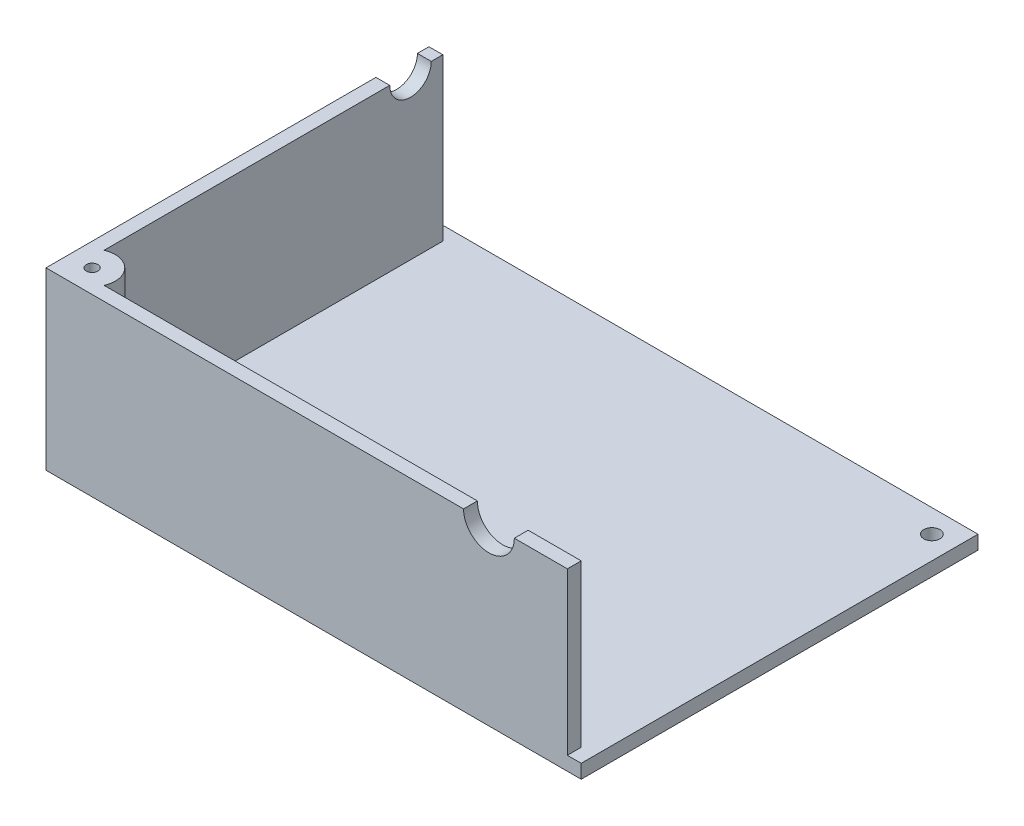
ISO-10303-21;
HEADER;
FILE_DESCRIPTION(('STEP AP214'),'2;1');
FILE_NAME('part.step','',(''),(''),'','','');
FILE_SCHEMA(('AUTOMOTIVE_DESIGN { 1 0 10303 214 1 1 1 1 }'));
ENDSEC;
DATA;
#1=APPLICATION_CONTEXT('core data for automotive mechanical design processes');
#2=APPLICATION_PROTOCOL_DEFINITION('international standard','automotive_design',2000,#1);
#3=PRODUCT_CONTEXT('',#1,'mechanical');
#4=PRODUCT('Part','Part','',(#3));
#5=PRODUCT_RELATED_PRODUCT_CATEGORY('part','',(#4));
#6=PRODUCT_DEFINITION_FORMATION('','',#4);
#7=PRODUCT_DEFINITION_CONTEXT('part definition',#1,'design');
#8=PRODUCT_DEFINITION('design','',#6,#7);
#9=PRODUCT_DEFINITION_SHAPE('','',#8);
#10=(LENGTH_UNIT() NAMED_UNIT(*) SI_UNIT(.MILLI.,.METRE.));
#11=(NAMED_UNIT(*) PLANE_ANGLE_UNIT() SI_UNIT($,.RADIAN.));
#12=(NAMED_UNIT(*) SI_UNIT($,.STERADIAN.) SOLID_ANGLE_UNIT());
#13=UNCERTAINTY_MEASURE_WITH_UNIT(LENGTH_MEASURE(1.E-05),#10,'distance_accuracy_value','');
#14=(GEOMETRIC_REPRESENTATION_CONTEXT(3) GLOBAL_UNCERTAINTY_ASSIGNED_CONTEXT((#13)) GLOBAL_UNIT_ASSIGNED_CONTEXT((#10,
#11,#12)) REPRESENTATION_CONTEXT('',''));
#15=CARTESIAN_POINT('',(0.,0.,0.));
#16=DIRECTION('',(0.,0.,1.));
#17=DIRECTION('',(1.,0.,0.));
#18=AXIS2_PLACEMENT_3D('',#15,#16,#17);
#19=CARTESIAN_POINT('',(0.,38.,0.));
#20=DIRECTION('',(0.,-1.,0.));
#21=DIRECTION('',(0.,0.,-1.));
#22=AXIS2_PLACEMENT_3D('',#19,#20,#21);
#23=PLANE('',#22);
#24=CARTESIAN_POINT('',(5.,38.,-5.));
#25=DIRECTION('',(0.,1.,0.));
#26=DIRECTION('',(0.,0.,1.));
#27=AXIS2_PLACEMENT_3D('',#24,#25,#26);
#28=CIRCLE('',#27,1.25);
#29=CARTESIAN_POINT('',(5.,38.,-3.75));
#30=VERTEX_POINT('',#29);
#31=EDGE_CURVE('E356',#30,#30,#28,.T.);
#32=ORIENTED_EDGE('',*,*,#31,.F.);
#33=EDGE_LOOP('',(#32));
#34=FACE_BOUND('',#33,.T.);
#35=DIRECTION('',(0.,0.,-1.));
#36=VECTOR('',#35,1.);
#37=CARTESIAN_POINT('',(3.,38.,-3.));
#38=LINE('',#37,#36);
#39=CARTESIAN_POINT('',(3.,38.,-9.58257569495585));
#40=VERTEX_POINT('',#39);
#41=CARTESIAN_POINT('',(3.,38.,-71.5));
#42=VERTEX_POINT('',#41);
#43=EDGE_CURVE('E159',#40,#42,#38,.T.);
#44=ORIENTED_EDGE('',*,*,#43,.T.);
#45=DIRECTION('',(-1.,0.,0.));
#46=VECTOR('',#45,1.);
#47=CARTESIAN_POINT('',(10.,38.,-71.5));
#48=LINE('',#47,#46);
#49=CARTESIAN_POINT('',(0.,38.,-71.5));
#50=VERTEX_POINT('',#49);
#51=EDGE_CURVE('E55',#42,#50,#48,.T.);
#52=ORIENTED_EDGE('',*,*,#51,.T.);
#53=DIRECTION('',(0.,0.,1.));
#54=VECTOR('',#53,1.);
#55=CARTESIAN_POINT('',(0.,38.,0.));
#56=LINE('',#55,#54);
#57=CARTESIAN_POINT('',(0.,38.,0.));
#58=VERTEX_POINT('',#57);
#59=EDGE_CURVE('E156',#50,#58,#56,.T.);
#60=ORIENTED_EDGE('',*,*,#59,.T.);
#61=DIRECTION('',(1.,0.,0.));
#62=VECTOR('',#61,1.);
#63=CARTESIAN_POINT('',(0.,38.,0.));
#64=LINE('',#63,#62);
#65=CARTESIAN_POINT('',(90.5,38.,0.));
#66=VERTEX_POINT('',#65);
#67=EDGE_CURVE('E181',#58,#66,#64,.T.);
#68=ORIENTED_EDGE('',*,*,#67,.T.);
#69=DIRECTION('',(0.,0.,1.));
#70=VECTOR('',#69,1.);
#71=CARTESIAN_POINT('',(90.5,38.,-10.));
#72=LINE('',#71,#70);
#73=CARTESIAN_POINT('',(90.5,38.,-3.));
#74=VERTEX_POINT('',#73);
#75=EDGE_CURVE('E249',#66,#74,#72,.F.);
#76=ORIENTED_EDGE('',*,*,#75,.T.);
#77=DIRECTION('',(-1.,0.,0.));
#78=VECTOR('',#77,1.);
#79=CARTESIAN_POINT('',(0.,38.,-3.));
#80=LINE('',#79,#78);
#81=CARTESIAN_POINT('',(9.58257569495584,38.,-3.));
#82=VERTEX_POINT('',#81);
#83=EDGE_CURVE('E187',#74,#82,#80,.T.);
#84=ORIENTED_EDGE('',*,*,#83,.T.);
#85=CARTESIAN_POINT('',(5.,38.,-5.));
#86=DIRECTION('',(0.,1.,0.));
#87=DIRECTION('',(0.,0.,1.));
#88=AXIS2_PLACEMENT_3D('',#85,#86,#87);
#89=CIRCLE('',#88,5.);
#90=EDGE_CURVE('E267',#82,#40,#89,.T.);
#91=ORIENTED_EDGE('',*,*,#90,.T.);
#92=EDGE_LOOP('',(#44,#52,#60,#68,#76,#84,#91));
#93=FACE_BOUND('',#92,.T.);
#94=ADVANCED_FACE('F39',(#34,#93),#23,.F.);
#95=CARTESIAN_POINT('',(113.,38.,-3.));
#96=VERTEX_POINT('',#95);
#97=CARTESIAN_POINT('',(101.5,38.,-3.));
#98=VERTEX_POINT('',#97);
#99=EDGE_CURVE('E188',#96,#98,#80,.T.);
#100=ORIENTED_EDGE('',*,*,#99,.T.);
#101=DIRECTION('',(0.,0.,1.));
#102=VECTOR('',#101,1.);
#103=CARTESIAN_POINT('',(101.5,38.,-10.));
#104=LINE('',#103,#102);
#105=CARTESIAN_POINT('',(101.5,38.,0.));
#106=VERTEX_POINT('',#105);
#107=EDGE_CURVE('E48',#98,#106,#104,.T.);
#108=ORIENTED_EDGE('',*,*,#107,.T.);
#109=CARTESIAN_POINT('',(113.,38.,0.));
#110=VERTEX_POINT('',#109);
#111=EDGE_CURVE('E173',#106,#110,#64,.T.);
#112=ORIENTED_EDGE('',*,*,#111,.T.);
#113=DIRECTION('',(0.,0.,-1.));
#114=VECTOR('',#113,1.);
#115=CARTESIAN_POINT('',(113.,38.,0.));
#116=LINE('',#115,#114);
#117=EDGE_CURVE('E184',#110,#96,#116,.T.);
#118=ORIENTED_EDGE('',*,*,#117,.T.);
#119=EDGE_LOOP('',(#100,#108,#112,#118));
#120=FACE_BOUND('',#119,.T.);
#121=ADVANCED_FACE('F255',(#120),#23,.F.);
#122=CARTESIAN_POINT('',(0.,3.,0.));
#123=DIRECTION('',(0.,-1.,0.));
#124=DIRECTION('',(0.,0.,-1.));
#125=AXIS2_PLACEMENT_3D('',#122,#123,#124);
#126=PLANE('',#125);
#127=CARTESIAN_POINT('',(111.,3.,-81.));
#128=DIRECTION('',(0.,-1.,0.));
#129=DIRECTION('',(0.,0.,-1.));
#130=AXIS2_PLACEMENT_3D('',#127,#128,#129);
#131=CIRCLE('',#130,1.75);
#132=CARTESIAN_POINT('',(111.,3.,-82.75));
#133=VERTEX_POINT('',#132);
#134=EDGE_CURVE('E290',#133,#133,#131,.T.);
#135=ORIENTED_EDGE('',*,*,#134,.T.);
#136=EDGE_LOOP('',(#135));
#137=FACE_BOUND('',#136,.T.);
#138=DIRECTION('',(0.,0.,-1.));
#139=VECTOR('',#138,1.);
#140=CARTESIAN_POINT('',(3.,3.,-3.));
#141=LINE('',#140,#139);
#142=CARTESIAN_POINT('',(3.,3.,-3.));
#143=VERTEX_POINT('',#142);
#144=CARTESIAN_POINT('',(3.,3.,-83.));
#145=VERTEX_POINT('',#144);
#146=EDGE_CURVE('E297',#143,#145,#141,.T.);
#147=ORIENTED_EDGE('',*,*,#146,.F.);
#148=DIRECTION('',(-1.,0.,0.));
#149=VECTOR('',#148,1.);
#150=CARTESIAN_POINT('',(0.,3.,-3.));
#151=LINE('',#150,#149);
#152=CARTESIAN_POINT('',(113.,3.,-3.));
#153=VERTEX_POINT('',#152);
#154=EDGE_CURVE('E169',#153,#143,#151,.T.);
#155=ORIENTED_EDGE('',*,*,#154,.F.);
#156=DIRECTION('',(0.,0.,-1.));
#157=VECTOR('',#156,1.);
#158=CARTESIAN_POINT('',(113.,3.,0.));
#159=LINE('',#158,#157);
#160=CARTESIAN_POINT('',(113.,3.,0.));
#161=VERTEX_POINT('',#160);
#162=EDGE_CURVE('E175',#161,#153,#159,.T.);
#163=ORIENTED_EDGE('',*,*,#162,.F.);
#164=DIRECTION('',(1.,0.,0.));
#165=VECTOR('',#164,1.);
#166=CARTESIAN_POINT('',(0.,3.,0.));
#167=LINE('',#166,#165);
#168=CARTESIAN_POINT('',(116.,3.,0.));
#169=VERTEX_POINT('',#168);
#170=EDGE_CURVE('E208',#161,#169,#167,.T.);
#171=ORIENTED_EDGE('',*,*,#170,.T.);
#172=DIRECTION('',(0.,0.,-1.));
#173=VECTOR('',#172,1.);
#174=CARTESIAN_POINT('',(116.,3.,0.));
#175=LINE('',#174,#173);
#176=CARTESIAN_POINT('',(116.,3.,-86.));
#177=VERTEX_POINT('',#176);
#178=EDGE_CURVE('E212',#169,#177,#175,.T.);
#179=ORIENTED_EDGE('',*,*,#178,.T.);
#180=DIRECTION('',(-1.,0.,0.));
#181=VECTOR('',#180,1.);
#182=CARTESIAN_POINT('',(0.,3.,-86.));
#183=LINE('',#182,#181);
#184=CARTESIAN_POINT('',(0.,3.,-86.));
#185=VERTEX_POINT('',#184);
#186=EDGE_CURVE('E215',#177,#185,#183,.T.);
#187=ORIENTED_EDGE('',*,*,#186,.T.);
#188=DIRECTION('',(0.,0.,1.));
#189=VECTOR('',#188,1.);
#190=CARTESIAN_POINT('',(0.,3.,0.));
#191=LINE('',#190,#189);
#192=CARTESIAN_POINT('',(0.,3.,-83.));
#193=VERTEX_POINT('',#192);
#194=EDGE_CURVE('E204',#185,#193,#191,.T.);
#195=ORIENTED_EDGE('',*,*,#194,.T.);
#196=DIRECTION('',(-1.,0.,0.));
#197=VECTOR('',#196,1.);
#198=CARTESIAN_POINT('',(0.,3.,-83.));
#199=LINE('',#198,#197);
#200=EDGE_CURVE('E308',#145,#193,#199,.T.);
#201=ORIENTED_EDGE('',*,*,#200,.F.);
#202=EDGE_LOOP('',(#147,#155,#163,#171,#179,#187,#195,#201));
#203=FACE_BOUND('',#202,.T.);
#204=ADVANCED_FACE('F327',(#137,#203),#126,.F.);
#205=CARTESIAN_POINT('',(0.,38.,-3.));
#206=DIRECTION('',(0.,0.,1.));
#207=DIRECTION('',(1.,0.,0.));
#208=AXIS2_PLACEMENT_3D('',#205,#206,#207);
#209=PLANE('',#208);
#210=ORIENTED_EDGE('',*,*,#83,.F.);
#211=CARTESIAN_POINT('',(96.,38.,-3.));
#212=DIRECTION('',(0.,0.,1.));
#213=DIRECTION('',(1.,0.,0.));
#214=AXIS2_PLACEMENT_3D('',#211,#212,#213);
#215=CIRCLE('',#214,5.5);
#216=EDGE_CURVE('E62',#74,#98,#215,.T.);
#217=ORIENTED_EDGE('',*,*,#216,.T.);
#218=ORIENTED_EDGE('',*,*,#99,.F.);
#219=DIRECTION('',(0.,-1.,0.));
#220=VECTOR('',#219,1.);
#221=CARTESIAN_POINT('',(113.,38.,-3.));
#222=LINE('',#221,#220);
#223=EDGE_CURVE('E192',#96,#153,#222,.T.);
#224=ORIENTED_EDGE('',*,*,#223,.T.);
#225=ORIENTED_EDGE('',*,*,#154,.T.);
#226=DIRECTION('',(0.,-1.,0.));
#227=VECTOR('',#226,1.);
#228=CARTESIAN_POINT('',(3.,38.,-3.));
#229=LINE('',#228,#227);
#230=CARTESIAN_POINT('',(3.,28.,-3.));
#231=VERTEX_POINT('',#230);
#232=EDGE_CURVE('E179',#231,#143,#229,.T.);
#233=ORIENTED_EDGE('',*,*,#232,.F.);
#234=DIRECTION('',(-1.,0.,0.));
#235=VECTOR('',#234,1.);
#236=CARTESIAN_POINT('',(0.,28.,-3.));
#237=LINE('',#236,#235);
#238=CARTESIAN_POINT('',(9.58257569495584,28.,-3.));
#239=VERTEX_POINT('',#238);
#240=EDGE_CURVE('E283',#239,#231,#237,.T.);
#241=ORIENTED_EDGE('',*,*,#240,.F.);
#242=DIRECTION('',(0.,1.,0.));
#243=VECTOR('',#242,1.);
#244=CARTESIAN_POINT('',(9.58257569495584,28.,-3.));
#245=LINE('',#244,#243);
#246=EDGE_CURVE('E274',#239,#82,#245,.T.);
#247=ORIENTED_EDGE('',*,*,#246,.T.);
#248=EDGE_LOOP('',(#210,#217,#218,#224,#225,#233,#241,#247));
#249=FACE_BOUND('',#248,.T.);
#250=ADVANCED_FACE('F281',(#249),#209,.F.);
#251=CARTESIAN_POINT('',(0.,3.,0.));
#252=DIRECTION('',(1.,0.,0.));
#253=DIRECTION('',(0.,0.,-1.));
#254=AXIS2_PLACEMENT_3D('',#251,#252,#253);
#255=PLANE('',#254);
#256=ORIENTED_EDGE('',*,*,#59,.F.);
#257=CARTESIAN_POINT('',(0.,38.,-76.));
#258=DIRECTION('',(-1.,0.,0.));
#259=DIRECTION('',(0.,0.,1.));
#260=AXIS2_PLACEMENT_3D('',#257,#258,#259);
#261=CIRCLE('',#260,4.50000000000001);
#262=CARTESIAN_POINT('',(0.,38.,-80.5));
#263=VERTEX_POINT('',#262);
#264=EDGE_CURVE('E144',#263,#50,#261,.T.);
#265=ORIENTED_EDGE('',*,*,#264,.F.);
#266=CARTESIAN_POINT('',(0.,38.,-83.));
#267=VERTEX_POINT('',#266);
#268=EDGE_CURVE('E168',#267,#263,#56,.T.);
#269=ORIENTED_EDGE('',*,*,#268,.F.);
#270=DIRECTION('',(0.,-1.,0.));
#271=VECTOR('',#270,1.);
#272=CARTESIAN_POINT('',(0.,38.,-83.));
#273=LINE('',#272,#271);
#274=EDGE_CURVE('E305',#267,#193,#273,.T.);
#275=ORIENTED_EDGE('',*,*,#274,.T.);
#276=ORIENTED_EDGE('',*,*,#194,.F.);
#277=DIRECTION('',(0.,-1.,0.));
#278=VECTOR('',#277,1.);
#279=CARTESIAN_POINT('',(0.,3.,-86.));
#280=LINE('',#279,#278);
#281=CARTESIAN_POINT('',(0.,0.,-86.));
#282=VERTEX_POINT('',#281);
#283=EDGE_CURVE('E218',#185,#282,#280,.T.);
#284=ORIENTED_EDGE('',*,*,#283,.T.);
#285=DIRECTION('',(0.,0.,1.));
#286=VECTOR('',#285,1.);
#287=CARTESIAN_POINT('',(0.,0.,0.));
#288=LINE('',#287,#286);
#289=CARTESIAN_POINT('',(0.,0.,0.));
#290=VERTEX_POINT('',#289);
#291=EDGE_CURVE('E203',#282,#290,#288,.T.);
#292=ORIENTED_EDGE('',*,*,#291,.T.);
#293=DIRECTION('',(0.,-1.,0.));
#294=VECTOR('',#293,1.);
#295=CARTESIAN_POINT('',(0.,3.,0.));
#296=LINE('',#295,#294);
#297=EDGE_CURVE('E165',#58,#290,#296,.T.);
#298=ORIENTED_EDGE('',*,*,#297,.F.);
#299=EDGE_LOOP('',(#256,#265,#269,#275,#276,#284,#292,#298));
#300=FACE_BOUND('',#299,.T.);
#301=ADVANCED_FACE('F41',(#300),#255,.F.);
#302=CARTESIAN_POINT('',(0.,3.,0.));
#303=DIRECTION('',(0.,0.,-1.));
#304=DIRECTION('',(-1.,0.,0.));
#305=AXIS2_PLACEMENT_3D('',#302,#303,#304);
#306=PLANE('',#305);
#307=ORIENTED_EDGE('',*,*,#111,.F.);
#308=CARTESIAN_POINT('',(96.,38.,0.));
#309=DIRECTION('',(0.,0.,1.));
#310=DIRECTION('',(1.,0.,0.));
#311=AXIS2_PLACEMENT_3D('',#308,#309,#310);
#312=CIRCLE('',#311,5.5);
#313=EDGE_CURVE('E161',#66,#106,#312,.T.);
#314=ORIENTED_EDGE('',*,*,#313,.F.);
#315=ORIENTED_EDGE('',*,*,#67,.F.);
#316=ORIENTED_EDGE('',*,*,#297,.T.);
#317=DIRECTION('',(1.,0.,0.));
#318=VECTOR('',#317,1.);
#319=CARTESIAN_POINT('',(0.,0.,0.));
#320=LINE('',#319,#318);
#321=CARTESIAN_POINT('',(116.,0.,0.));
#322=VERTEX_POINT('',#321);
#323=EDGE_CURVE('E221',#290,#322,#320,.T.);
#324=ORIENTED_EDGE('',*,*,#323,.T.);
#325=DIRECTION('',(0.,-1.,0.));
#326=VECTOR('',#325,1.);
#327=CARTESIAN_POINT('',(116.,3.,0.));
#328=LINE('',#327,#326);
#329=EDGE_CURVE('E236',#169,#322,#328,.T.);
#330=ORIENTED_EDGE('',*,*,#329,.F.);
#331=ORIENTED_EDGE('',*,*,#170,.F.);
#332=DIRECTION('',(0.,-1.,0.));
#333=VECTOR('',#332,1.);
#334=CARTESIAN_POINT('',(113.,38.,0.));
#335=LINE('',#334,#333);
#336=EDGE_CURVE('E199',#110,#161,#335,.T.);
#337=ORIENTED_EDGE('',*,*,#336,.F.);
#338=EDGE_LOOP('',(#307,#314,#315,#316,#324,#330,#331,#337));
#339=FACE_BOUND('',#338,.T.);
#340=ADVANCED_FACE('F260',(#339),#306,.F.);
#341=CARTESIAN_POINT('',(116.,3.,0.));
#342=DIRECTION('',(-1.,0.,0.));
#343=DIRECTION('',(0.,0.,1.));
#344=AXIS2_PLACEMENT_3D('',#341,#342,#343);
#345=PLANE('',#344);
#346=DIRECTION('',(0.,0.,-1.));
#347=VECTOR('',#346,1.);
#348=CARTESIAN_POINT('',(116.,0.,0.));
#349=LINE('',#348,#347);
#350=CARTESIAN_POINT('',(116.,0.,-86.));
#351=VERTEX_POINT('',#350);
#352=EDGE_CURVE('E224',#322,#351,#349,.T.);
#353=ORIENTED_EDGE('',*,*,#352,.T.);
#354=DIRECTION('',(0.,-1.,0.));
#355=VECTOR('',#354,1.);
#356=CARTESIAN_POINT('',(116.,3.,-86.));
#357=LINE('',#356,#355);
#358=EDGE_CURVE('E232',#177,#351,#357,.T.);
#359=ORIENTED_EDGE('',*,*,#358,.F.);
#360=ORIENTED_EDGE('',*,*,#178,.F.);
#361=ORIENTED_EDGE('',*,*,#329,.T.);
#362=EDGE_LOOP('',(#353,#359,#360,#361));
#363=FACE_BOUND('',#362,.T.);
#364=ADVANCED_FACE('F336',(#363),#345,.F.);
#365=CARTESIAN_POINT('',(0.,3.,-86.));
#366=DIRECTION('',(0.,0.,1.));
#367=DIRECTION('',(1.,0.,0.));
#368=AXIS2_PLACEMENT_3D('',#365,#366,#367);
#369=PLANE('',#368);
#370=DIRECTION('',(-1.,0.,0.));
#371=VECTOR('',#370,1.);
#372=CARTESIAN_POINT('',(0.,0.,-86.));
#373=LINE('',#372,#371);
#374=EDGE_CURVE('E209',#351,#282,#373,.T.);
#375=ORIENTED_EDGE('',*,*,#374,.T.);
#376=ORIENTED_EDGE('',*,*,#283,.F.);
#377=ORIENTED_EDGE('',*,*,#186,.F.);
#378=ORIENTED_EDGE('',*,*,#358,.T.);
#379=EDGE_LOOP('',(#375,#376,#377,#378));
#380=FACE_BOUND('',#379,.T.);
#381=ADVANCED_FACE('F341',(#380),#369,.F.);
#382=CARTESIAN_POINT('',(0.,0.,0.));
#383=DIRECTION('',(0.,-1.,0.));
#384=DIRECTION('',(0.,0.,-1.));
#385=AXIS2_PLACEMENT_3D('',#382,#383,#384);
#386=PLANE('',#385);
#387=CARTESIAN_POINT('',(111.,0.,-81.));
#388=DIRECTION('',(0.,-1.,0.));
#389=DIRECTION('',(0.,0.,-1.));
#390=AXIS2_PLACEMENT_3D('',#387,#388,#389);
#391=CIRCLE('',#390,1.75);
#392=CARTESIAN_POINT('',(111.,0.,-82.75));
#393=VERTEX_POINT('',#392);
#394=EDGE_CURVE('E285',#393,#393,#391,.T.);
#395=ORIENTED_EDGE('',*,*,#394,.F.);
#396=EDGE_LOOP('',(#395));
#397=FACE_BOUND('',#396,.T.);
#398=ORIENTED_EDGE('',*,*,#291,.F.);
#399=ORIENTED_EDGE('',*,*,#374,.F.);
#400=ORIENTED_EDGE('',*,*,#352,.F.);
#401=ORIENTED_EDGE('',*,*,#323,.F.);
#402=EDGE_LOOP('',(#398,#399,#400,#401));
#403=FACE_BOUND('',#402,.T.);
#404=ADVANCED_FACE('F393',(#397,#403),#386,.T.);
#405=CARTESIAN_POINT('',(113.,38.,0.));
#406=DIRECTION('',(-1.,0.,0.));
#407=DIRECTION('',(0.,0.,1.));
#408=AXIS2_PLACEMENT_3D('',#405,#406,#407);
#409=PLANE('',#408);
#410=ORIENTED_EDGE('',*,*,#162,.T.);
#411=ORIENTED_EDGE('',*,*,#223,.F.);
#412=ORIENTED_EDGE('',*,*,#117,.F.);
#413=ORIENTED_EDGE('',*,*,#336,.T.);
#414=EDGE_LOOP('',(#410,#411,#412,#413));
#415=FACE_BOUND('',#414,.T.);
#416=ADVANCED_FACE('F330',(#415),#409,.F.);
#417=ORIENTED_EDGE('',*,*,#268,.T.);
#418=DIRECTION('',(-1.,0.,0.));
#419=VECTOR('',#418,1.);
#420=CARTESIAN_POINT('',(10.,38.,-80.5));
#421=LINE('',#420,#419);
#422=CARTESIAN_POINT('',(3.,38.,-80.5));
#423=VERTEX_POINT('',#422);
#424=EDGE_CURVE('E147',#263,#423,#421,.F.);
#425=ORIENTED_EDGE('',*,*,#424,.T.);
#426=CARTESIAN_POINT('',(3.,38.,-83.));
#427=VERTEX_POINT('',#426);
#428=EDGE_CURVE('E301',#423,#427,#38,.T.);
#429=ORIENTED_EDGE('',*,*,#428,.T.);
#430=DIRECTION('',(-1.,0.,0.));
#431=VECTOR('',#430,1.);
#432=CARTESIAN_POINT('',(0.,38.,-83.));
#433=LINE('',#432,#431);
#434=EDGE_CURVE('E300',#427,#267,#433,.T.);
#435=ORIENTED_EDGE('',*,*,#434,.T.);
#436=EDGE_LOOP('',(#417,#425,#429,#435));
#437=FACE_BOUND('',#436,.T.);
#438=ADVANCED_FACE('F347',(#437),#23,.F.);
#439=CARTESIAN_POINT('',(3.,38.,-3.));
#440=DIRECTION('',(-1.,0.,0.));
#441=DIRECTION('',(0.,0.,1.));
#442=AXIS2_PLACEMENT_3D('',#439,#440,#441);
#443=PLANE('',#442);
#444=ORIENTED_EDGE('',*,*,#428,.F.);
#445=CARTESIAN_POINT('',(3.,38.,-76.));
#446=DIRECTION('',(-1.,0.,0.));
#447=DIRECTION('',(0.,0.,1.));
#448=AXIS2_PLACEMENT_3D('',#445,#446,#447);
#449=CIRCLE('',#448,4.50000000000001);
#450=EDGE_CURVE('E11',#423,#42,#449,.T.);
#451=ORIENTED_EDGE('',*,*,#450,.T.);
#452=ORIENTED_EDGE('',*,*,#43,.F.);
#453=DIRECTION('',(0.,1.,0.));
#454=VECTOR('',#453,1.);
#455=CARTESIAN_POINT('',(3.,28.,-9.58257569495585));
#456=LINE('',#455,#454);
#457=CARTESIAN_POINT('',(3.,28.,-9.58257569495585));
#458=VERTEX_POINT('',#457);
#459=EDGE_CURVE('E245',#40,#458,#456,.F.);
#460=ORIENTED_EDGE('',*,*,#459,.T.);
#461=DIRECTION('',(0.,0.,-1.));
#462=VECTOR('',#461,1.);
#463=CARTESIAN_POINT('',(3.,28.,-3.));
#464=LINE('',#463,#462);
#465=EDGE_CURVE('E242',#231,#458,#464,.T.);
#466=ORIENTED_EDGE('',*,*,#465,.F.);
#467=ORIENTED_EDGE('',*,*,#232,.T.);
#468=ORIENTED_EDGE('',*,*,#146,.T.);
#469=DIRECTION('',(0.,-1.,0.));
#470=VECTOR('',#469,1.);
#471=CARTESIAN_POINT('',(3.,38.,-83.));
#472=LINE('',#471,#470);
#473=EDGE_CURVE('E313',#427,#145,#472,.T.);
#474=ORIENTED_EDGE('',*,*,#473,.F.);
#475=EDGE_LOOP('',(#444,#451,#452,#460,#466,#467,#468,#474));
#476=FACE_BOUND('',#475,.T.);
#477=ADVANCED_FACE('F325',(#476),#443,.F.);
#478=CARTESIAN_POINT('',(0.,38.,-83.));
#479=DIRECTION('',(0.,0.,1.));
#480=DIRECTION('',(1.,0.,0.));
#481=AXIS2_PLACEMENT_3D('',#478,#479,#480);
#482=PLANE('',#481);
#483=ORIENTED_EDGE('',*,*,#200,.T.);
#484=ORIENTED_EDGE('',*,*,#274,.F.);
#485=ORIENTED_EDGE('',*,*,#434,.F.);
#486=ORIENTED_EDGE('',*,*,#473,.T.);
#487=EDGE_LOOP('',(#483,#484,#485,#486));
#488=FACE_BOUND('',#487,.T.);
#489=ADVANCED_FACE('F345',(#488),#482,.F.);
#490=CARTESIAN_POINT('',(111.,35.,-81.));
#491=DIRECTION('',(0.,-1.,0.));
#492=DIRECTION('',(0.,0.,-1.));
#493=AXIS2_PLACEMENT_3D('',#490,#491,#492);
#494=CYLINDRICAL_SURFACE('',#493,1.75);
#495=ORIENTED_EDGE('',*,*,#394,.T.);
#496=EDGE_LOOP('',(#495));
#497=FACE_BOUND('',#496,.T.);
#498=ORIENTED_EDGE('',*,*,#134,.F.);
#499=EDGE_LOOP('',(#498));
#500=FACE_BOUND('',#499,.T.);
#501=ADVANCED_FACE('F377',(#497,#500),#494,.F.);
#502=CARTESIAN_POINT('',(5.,28.,-5.));
#503=DIRECTION('',(0.,1.,0.));
#504=DIRECTION('',(0.,0.,1.));
#505=AXIS2_PLACEMENT_3D('',#502,#503,#504);
#506=CYLINDRICAL_SURFACE('',#505,5.);
#507=ORIENTED_EDGE('',*,*,#246,.F.);
#508=CARTESIAN_POINT('',(5.,28.,-5.));
#509=DIRECTION('',(0.,1.,0.));
#510=DIRECTION('',(0.,0.,1.));
#511=AXIS2_PLACEMENT_3D('',#508,#509,#510);
#512=CIRCLE('',#511,5.);
#513=EDGE_CURVE('E277',#239,#458,#512,.T.);
#514=ORIENTED_EDGE('',*,*,#513,.T.);
#515=ORIENTED_EDGE('',*,*,#459,.F.);
#516=ORIENTED_EDGE('',*,*,#90,.F.);
#517=EDGE_LOOP('',(#507,#514,#515,#516));
#518=FACE_BOUND('',#517,.T.);
#519=ADVANCED_FACE('F272',(#518),#506,.T.);
#520=CARTESIAN_POINT('',(5.,28.,-5.));
#521=DIRECTION('',(0.,1.,0.));
#522=DIRECTION('',(0.,0.,1.));
#523=AXIS2_PLACEMENT_3D('',#520,#521,#522);
#524=PLANE('',#523);
#525=CARTESIAN_POINT('',(5.,28.,-5.));
#526=DIRECTION('',(0.,1.,0.));
#527=DIRECTION('',(0.,0.,1.));
#528=AXIS2_PLACEMENT_3D('',#525,#526,#527);
#529=CIRCLE('',#528,1.25);
#530=CARTESIAN_POINT('',(5.,28.,-3.75));
#531=VERTEX_POINT('',#530);
#532=EDGE_CURVE('E278',#531,#531,#529,.T.);
#533=ORIENTED_EDGE('',*,*,#532,.T.);
#534=EDGE_LOOP('',(#533));
#535=FACE_BOUND('',#534,.T.);
#536=ORIENTED_EDGE('',*,*,#513,.F.);
#537=ORIENTED_EDGE('',*,*,#240,.T.);
#538=ORIENTED_EDGE('',*,*,#465,.T.);
#539=EDGE_LOOP('',(#536,#537,#538));
#540=FACE_BOUND('',#539,.T.);
#541=ADVANCED_FACE('F365',(#535,#540),#524,.F.);
#542=CARTESIAN_POINT('',(5.,28.,-5.));
#543=DIRECTION('',(0.,1.,0.));
#544=DIRECTION('',(0.,0.,1.));
#545=AXIS2_PLACEMENT_3D('',#542,#543,#544);
#546=CYLINDRICAL_SURFACE('',#545,1.25);
#547=ORIENTED_EDGE('',*,*,#532,.F.);
#548=EDGE_LOOP('',(#547));
#549=FACE_BOUND('',#548,.T.);
#550=ORIENTED_EDGE('',*,*,#31,.T.);
#551=EDGE_LOOP('',(#550));
#552=FACE_BOUND('',#551,.T.);
#553=ADVANCED_FACE('F367',(#549,#552),#546,.F.);
#554=CARTESIAN_POINT('',(96.,38.,-10.));
#555=DIRECTION('',(0.,0.,1.));
#556=DIRECTION('',(1.,0.,0.));
#557=AXIS2_PLACEMENT_3D('',#554,#555,#556);
#558=CYLINDRICAL_SURFACE('',#557,5.5);
#559=ORIENTED_EDGE('',*,*,#216,.F.);
#560=ORIENTED_EDGE('',*,*,#75,.F.);
#561=ORIENTED_EDGE('',*,*,#313,.T.);
#562=ORIENTED_EDGE('',*,*,#107,.F.);
#563=EDGE_LOOP('',(#559,#560,#561,#562));
#564=FACE_BOUND('',#563,.T.);
#565=ADVANCED_FACE('F374',(#564),#558,.F.);
#566=CARTESIAN_POINT('',(10.,38.,-76.));
#567=DIRECTION('',(-1.,0.,0.));
#568=DIRECTION('',(0.,0.,1.));
#569=AXIS2_PLACEMENT_3D('',#566,#567,#568);
#570=CYLINDRICAL_SURFACE('',#569,4.50000000000001);
#571=ORIENTED_EDGE('',*,*,#450,.F.);
#572=ORIENTED_EDGE('',*,*,#424,.F.);
#573=ORIENTED_EDGE('',*,*,#264,.T.);
#574=ORIENTED_EDGE('',*,*,#51,.F.);
#575=EDGE_LOOP('',(#571,#572,#573,#574));
#576=FACE_BOUND('',#575,.T.);
#577=ADVANCED_FACE('F145',(#576),#570,.F.);
#578=CLOSED_SHELL('',(#94,#121,#204,#250,#301,#340,#364,#381,#404,#416,#438,#477,#489,#501,#519,
#541,#553,#565,#577));
#579=MANIFOLD_SOLID_BREP('B2',#578);
#580=ADVANCED_BREP_SHAPE_REPRESENTATION('',(#18,#579),#14);
#581=SHAPE_DEFINITION_REPRESENTATION(#9,#580);
ENDSEC;
END-ISO-10303-21;
